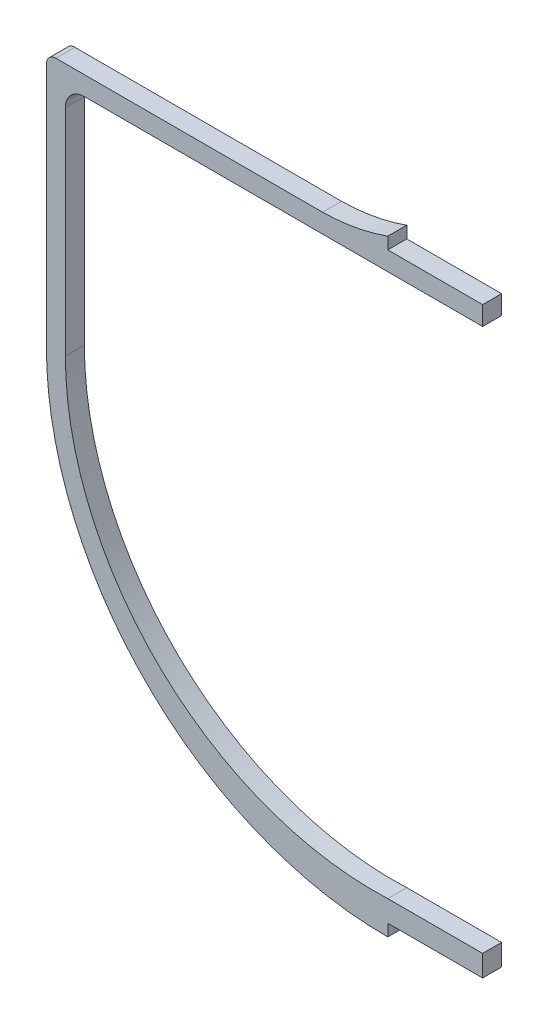
ISO-10303-21;
HEADER;
FILE_DESCRIPTION(('STEP AP214'),'2;1');
FILE_NAME('part.step','',(''),(''),'','','');
FILE_SCHEMA(('AUTOMOTIVE_DESIGN { 1 0 10303 214 1 1 1 1 }'));
ENDSEC;
DATA;
#1=APPLICATION_CONTEXT('core data for automotive mechanical design processes');
#2=APPLICATION_PROTOCOL_DEFINITION('international standard','automotive_design',2000,#1);
#3=PRODUCT_CONTEXT('',#1,'mechanical');
#4=PRODUCT('Part','Part','',(#3));
#5=PRODUCT_RELATED_PRODUCT_CATEGORY('part','',(#4));
#6=PRODUCT_DEFINITION_FORMATION('','',#4);
#7=PRODUCT_DEFINITION_CONTEXT('part definition',#1,'design');
#8=PRODUCT_DEFINITION('design','',#6,#7);
#9=PRODUCT_DEFINITION_SHAPE('','',#8);
#10=(LENGTH_UNIT() NAMED_UNIT(*) SI_UNIT(.MILLI.,.METRE.));
#11=(NAMED_UNIT(*) PLANE_ANGLE_UNIT() SI_UNIT($,.RADIAN.));
#12=(NAMED_UNIT(*) SI_UNIT($,.STERADIAN.) SOLID_ANGLE_UNIT());
#13=UNCERTAINTY_MEASURE_WITH_UNIT(LENGTH_MEASURE(1.E-05),#10,'distance_accuracy_value','');
#14=(GEOMETRIC_REPRESENTATION_CONTEXT(3) GLOBAL_UNCERTAINTY_ASSIGNED_CONTEXT((#13)) GLOBAL_UNIT_ASSIGNED_CONTEXT((#10,
#11,#12)) REPRESENTATION_CONTEXT('',''));
#15=CARTESIAN_POINT('',(0.,0.,0.));
#16=DIRECTION('',(0.,0.,1.));
#17=DIRECTION('',(1.,0.,0.));
#18=AXIS2_PLACEMENT_3D('',#15,#16,#17);
#19=CARTESIAN_POINT('',(-0.274438164377958,71.725981806473,4.));
#20=DIRECTION('',(0.,0.,-1.));
#21=DIRECTION('',(-1.,0.,0.));
#22=AXIS2_PLACEMENT_3D('',#19,#20,#21);
#23=CYLINDRICAL_SURFACE('',#22,71.7265068326108);
#24=CARTESIAN_POINT('',(-0.274438164377958,71.725981806473,0.));
#25=DIRECTION('',(0.,0.,1.));
#26=DIRECTION('',(1.,0.,0.));
#27=AXIS2_PLACEMENT_3D('',#24,#25,#26);
#28=CIRCLE('',#27,71.7265068326108);
#29=CARTESIAN_POINT('',(-72.,72.094168950364,0.));
#30=VERTEX_POINT('',#29);
#31=CARTESIAN_POINT('',(0.,0.,0.));
#32=VERTEX_POINT('',#31);
#33=EDGE_CURVE('E176',#30,#32,#28,.T.);
#34=ORIENTED_EDGE('',*,*,#33,.T.);
#35=DIRECTION('',(0.,0.,-1.));
#36=VECTOR('',#35,1.);
#37=CARTESIAN_POINT('',(0.,0.,4.));
#38=LINE('',#37,#36);
#39=CARTESIAN_POINT('',(0.,0.,4.));
#40=VERTEX_POINT('',#39);
#41=EDGE_CURVE('E155',#40,#32,#38,.T.);
#42=ORIENTED_EDGE('',*,*,#41,.F.);
#43=CARTESIAN_POINT('',(-0.274438164377958,71.725981806473,4.));
#44=DIRECTION('',(0.,0.,1.));
#45=DIRECTION('',(1.,0.,0.));
#46=AXIS2_PLACEMENT_3D('',#43,#44,#45);
#47=CIRCLE('',#46,71.7265068326108);
#48=CARTESIAN_POINT('',(-72.,72.094168950364,4.));
#49=VERTEX_POINT('',#48);
#50=EDGE_CURVE('E163',#49,#40,#47,.T.);
#51=ORIENTED_EDGE('',*,*,#50,.F.);
#52=DIRECTION('',(0.,0.,-1.));
#53=VECTOR('',#52,1.);
#54=CARTESIAN_POINT('',(-72.,72.094168950364,4.));
#55=LINE('',#54,#53);
#56=EDGE_CURVE('E217',#49,#30,#55,.T.);
#57=ORIENTED_EDGE('',*,*,#56,.T.);
#58=EDGE_LOOP('',(#34,#42,#51,#57));
#59=FACE_BOUND('',#58,.T.);
#60=ADVANCED_FACE('F38',(#59),#23,.T.);
#61=CARTESIAN_POINT('',(0.,0.,4.));
#62=DIRECTION('',(-1.,0.,0.));
#63=DIRECTION('',(0.,0.,1.));
#64=AXIS2_PLACEMENT_3D('',#61,#62,#63);
#65=PLANE('',#64);
#66=DIRECTION('',(0.,1.,0.));
#67=VECTOR('',#66,1.);
#68=CARTESIAN_POINT('',(0.,0.,0.));
#69=LINE('',#68,#67);
#70=CARTESIAN_POINT('',(0.,2.5,0.));
#71=VERTEX_POINT('',#70);
#72=EDGE_CURVE('E273',#32,#71,#69,.T.);
#73=ORIENTED_EDGE('',*,*,#72,.T.);
#74=DIRECTION('',(0.,0.,-1.));
#75=VECTOR('',#74,1.);
#76=CARTESIAN_POINT('',(0.,2.5,4.));
#77=LINE('',#76,#75);
#78=CARTESIAN_POINT('',(0.,2.5,4.));
#79=VERTEX_POINT('',#78);
#80=EDGE_CURVE('E158',#79,#71,#77,.T.);
#81=ORIENTED_EDGE('',*,*,#80,.F.);
#82=DIRECTION('',(0.,1.,0.));
#83=VECTOR('',#82,1.);
#84=CARTESIAN_POINT('',(0.,0.,4.));
#85=LINE('',#84,#83);
#86=EDGE_CURVE('E151',#40,#79,#85,.T.);
#87=ORIENTED_EDGE('',*,*,#86,.F.);
#88=ORIENTED_EDGE('',*,*,#41,.T.);
#89=EDGE_LOOP('',(#73,#81,#87,#88));
#90=FACE_BOUND('',#89,.T.);
#91=ADVANCED_FACE('F153',(#90),#65,.F.);
#92=CARTESIAN_POINT('',(0.,2.5,4.));
#93=DIRECTION('',(0.,1.,0.));
#94=DIRECTION('',(0.,0.,1.));
#95=AXIS2_PLACEMENT_3D('',#92,#93,#94);
#96=PLANE('',#95);
#97=DIRECTION('',(1.,0.,0.));
#98=VECTOR('',#97,1.);
#99=CARTESIAN_POINT('',(0.,2.5,0.));
#100=LINE('',#99,#98);
#101=CARTESIAN_POINT('',(20.,2.5,0.));
#102=VERTEX_POINT('',#101);
#103=EDGE_CURVE('E264',#71,#102,#100,.T.);
#104=ORIENTED_EDGE('',*,*,#103,.T.);
#105=DIRECTION('',(0.,0.,-1.));
#106=VECTOR('',#105,1.);
#107=CARTESIAN_POINT('',(20.,2.5,4.));
#108=LINE('',#107,#106);
#109=CARTESIAN_POINT('',(20.,2.5,4.));
#110=VERTEX_POINT('',#109);
#111=EDGE_CURVE('E185',#110,#102,#108,.T.);
#112=ORIENTED_EDGE('',*,*,#111,.F.);
#113=DIRECTION('',(1.,0.,0.));
#114=VECTOR('',#113,1.);
#115=CARTESIAN_POINT('',(0.,2.5,4.));
#116=LINE('',#115,#114);
#117=EDGE_CURVE('E162',#79,#110,#116,.T.);
#118=ORIENTED_EDGE('',*,*,#117,.F.);
#119=ORIENTED_EDGE('',*,*,#80,.T.);
#120=EDGE_LOOP('',(#104,#112,#118,#119));
#121=FACE_BOUND('',#120,.T.);
#122=ADVANCED_FACE('F317',(#121),#96,.F.);
#123=CARTESIAN_POINT('',(20.,2.5,4.));
#124=DIRECTION('',(-1.,0.,0.));
#125=DIRECTION('',(0.,0.,1.));
#126=AXIS2_PLACEMENT_3D('',#123,#124,#125);
#127=PLANE('',#126);
#128=DIRECTION('',(0.,1.,0.));
#129=VECTOR('',#128,1.);
#130=CARTESIAN_POINT('',(20.,2.5,0.));
#131=LINE('',#130,#129);
#132=CARTESIAN_POINT('',(20.,7.,0.));
#133=VERTEX_POINT('',#132);
#134=EDGE_CURVE('E259',#102,#133,#131,.T.);
#135=ORIENTED_EDGE('',*,*,#134,.T.);
#136=DIRECTION('',(0.,0.,-1.));
#137=VECTOR('',#136,1.);
#138=CARTESIAN_POINT('',(20.,7.,4.));
#139=LINE('',#138,#137);
#140=CARTESIAN_POINT('',(20.,7.,4.));
#141=VERTEX_POINT('',#140);
#142=EDGE_CURVE('E248',#141,#133,#139,.T.);
#143=ORIENTED_EDGE('',*,*,#142,.F.);
#144=DIRECTION('',(0.,1.,0.));
#145=VECTOR('',#144,1.);
#146=CARTESIAN_POINT('',(20.,2.5,4.));
#147=LINE('',#146,#145);
#148=EDGE_CURVE('E260',#110,#141,#147,.T.);
#149=ORIENTED_EDGE('',*,*,#148,.F.);
#150=ORIENTED_EDGE('',*,*,#111,.T.);
#151=EDGE_LOOP('',(#135,#143,#149,#150));
#152=FACE_BOUND('',#151,.T.);
#153=ADVANCED_FACE('F257',(#152),#127,.F.);
#154=CARTESIAN_POINT('',(20.,7.,4.));
#155=DIRECTION('',(0.,-1.,0.));
#156=DIRECTION('',(1.,0.,0.));
#157=AXIS2_PLACEMENT_3D('',#154,#155,#156);
#158=PLANE('',#157);
#159=DIRECTION('',(-1.,0.,0.));
#160=VECTOR('',#159,1.);
#161=CARTESIAN_POINT('',(20.,7.,0.));
#162=LINE('',#161,#160);
#163=CARTESIAN_POINT('',(0.,7.,0.));
#164=VERTEX_POINT('',#163);
#165=EDGE_CURVE('E266',#133,#164,#162,.T.);
#166=ORIENTED_EDGE('',*,*,#165,.T.);
#167=DIRECTION('',(0.,0.,-1.));
#168=VECTOR('',#167,1.);
#169=CARTESIAN_POINT('',(0.,7.,4.));
#170=LINE('',#169,#168);
#171=CARTESIAN_POINT('',(0.,7.,4.));
#172=VERTEX_POINT('',#171);
#173=EDGE_CURVE('E244',#172,#164,#170,.T.);
#174=ORIENTED_EDGE('',*,*,#173,.F.);
#175=DIRECTION('',(-1.,0.,0.));
#176=VECTOR('',#175,1.);
#177=CARTESIAN_POINT('',(20.,7.,4.));
#178=LINE('',#177,#176);
#179=EDGE_CURVE('E321',#141,#172,#178,.T.);
#180=ORIENTED_EDGE('',*,*,#179,.F.);
#181=ORIENTED_EDGE('',*,*,#142,.T.);
#182=EDGE_LOOP('',(#166,#174,#180,#181));
#183=FACE_BOUND('',#182,.T.);
#184=ADVANCED_FACE('F376',(#183),#158,.F.);
#185=CARTESIAN_POINT('',(-2.8437438872209,72.0941689503596,4.));
#186=DIRECTION('',(0.,0.,-1.));
#187=DIRECTION('',(-1.,0.,0.));
#188=AXIS2_PLACEMENT_3D('',#185,#186,#187);
#189=CYLINDRICAL_SURFACE('',#188,65.1562561127791);
#190=CARTESIAN_POINT('',(-2.8437438872209,72.0941689503596,0.));
#191=DIRECTION('',(0.,0.,-1.));
#192=DIRECTION('',(1.,0.,0.));
#193=AXIS2_PLACEMENT_3D('',#190,#191,#192);
#194=CIRCLE('',#193,65.1562561127791);
#195=CARTESIAN_POINT('',(-68.,72.0941689503596,0.));
#196=VERTEX_POINT('',#195);
#197=EDGE_CURVE('E271',#164,#196,#194,.T.);
#198=ORIENTED_EDGE('',*,*,#197,.T.);
#199=DIRECTION('',(0.,0.,-1.));
#200=VECTOR('',#199,1.);
#201=CARTESIAN_POINT('',(-68.,72.0941689503596,4.));
#202=LINE('',#201,#200);
#203=CARTESIAN_POINT('',(-68.,72.0941689503596,4.));
#204=VERTEX_POINT('',#203);
#205=EDGE_CURVE('E240',#204,#196,#202,.T.);
#206=ORIENTED_EDGE('',*,*,#205,.F.);
#207=CARTESIAN_POINT('',(-2.8437438872209,72.0941689503596,4.));
#208=DIRECTION('',(0.,0.,-1.));
#209=DIRECTION('',(1.,0.,0.));
#210=AXIS2_PLACEMENT_3D('',#207,#208,#209);
#211=CIRCLE('',#210,65.1562561127791);
#212=EDGE_CURVE('E326',#172,#204,#211,.T.);
#213=ORIENTED_EDGE('',*,*,#212,.F.);
#214=ORIENTED_EDGE('',*,*,#173,.T.);
#215=EDGE_LOOP('',(#198,#206,#213,#214));
#216=FACE_BOUND('',#215,.T.);
#217=ADVANCED_FACE('F374',(#216),#189,.F.);
#218=CARTESIAN_POINT('',(-68.,121.5,4.));
#219=DIRECTION('',(-1.,0.,0.));
#220=DIRECTION('',(0.,-1.,0.));
#221=AXIS2_PLACEMENT_3D('',#218,#219,#220);
#222=PLANE('',#221);
#223=DIRECTION('',(0.,1.,0.));
#224=VECTOR('',#223,1.);
#225=CARTESIAN_POINT('',(-68.,121.5,0.));
#226=LINE('',#225,#224);
#227=CARTESIAN_POINT('',(-68.,117.5,0.));
#228=VERTEX_POINT('',#227);
#229=EDGE_CURVE('E279',#196,#228,#226,.T.);
#230=ORIENTED_EDGE('',*,*,#229,.T.);
#231=DIRECTION('',(0.,0.,-1.));
#232=VECTOR('',#231,1.);
#233=CARTESIAN_POINT('',(-68.,117.5,4.));
#234=LINE('',#233,#232);
#235=CARTESIAN_POINT('',(-68.,117.5,4.));
#236=VERTEX_POINT('',#235);
#237=EDGE_CURVE('E183',#228,#236,#234,.F.);
#238=ORIENTED_EDGE('',*,*,#237,.T.);
#239=DIRECTION('',(0.,1.,0.));
#240=VECTOR('',#239,1.);
#241=CARTESIAN_POINT('',(-68.,121.5,4.));
#242=LINE('',#241,#240);
#243=EDGE_CURVE('E329',#204,#236,#242,.T.);
#244=ORIENTED_EDGE('',*,*,#243,.F.);
#245=ORIENTED_EDGE('',*,*,#205,.T.);
#246=EDGE_LOOP('',(#230,#238,#244,#245));
#247=FACE_BOUND('',#246,.T.);
#248=ADVANCED_FACE('F365',(#247),#222,.F.);
#249=CARTESIAN_POINT('',(-68.,121.5,4.));
#250=DIRECTION('',(0.,1.,0.));
#251=DIRECTION('',(-1.,0.,0.));
#252=AXIS2_PLACEMENT_3D('',#249,#250,#251);
#253=PLANE('',#252);
#254=DIRECTION('',(1.,0.,0.));
#255=VECTOR('',#254,1.);
#256=CARTESIAN_POINT('',(-68.,121.5,4.));
#257=LINE('',#256,#255);
#258=CARTESIAN_POINT('',(-64.,121.5,4.));
#259=VERTEX_POINT('',#258);
#260=CARTESIAN_POINT('',(20.,121.5,4.));
#261=VERTEX_POINT('',#260);
#262=EDGE_CURVE('E333',#259,#261,#257,.T.);
#263=ORIENTED_EDGE('',*,*,#262,.F.);
#264=DIRECTION('',(0.,0.,-1.));
#265=VECTOR('',#264,1.);
#266=CARTESIAN_POINT('',(-64.,121.5,0.));
#267=LINE('',#266,#265);
#268=CARTESIAN_POINT('',(-64.,121.5,0.));
#269=VERTEX_POINT('',#268);
#270=EDGE_CURVE('E178',#259,#269,#267,.T.);
#271=ORIENTED_EDGE('',*,*,#270,.T.);
#272=DIRECTION('',(1.,0.,0.));
#273=VECTOR('',#272,1.);
#274=CARTESIAN_POINT('',(-68.,121.5,0.));
#275=LINE('',#274,#273);
#276=CARTESIAN_POINT('',(20.,121.5,0.));
#277=VERTEX_POINT('',#276);
#278=EDGE_CURVE('E283',#269,#277,#275,.T.);
#279=ORIENTED_EDGE('',*,*,#278,.T.);
#280=DIRECTION('',(0.,0.,-1.));
#281=VECTOR('',#280,1.);
#282=CARTESIAN_POINT('',(20.,121.5,4.));
#283=LINE('',#282,#281);
#284=EDGE_CURVE('E236',#261,#277,#283,.T.);
#285=ORIENTED_EDGE('',*,*,#284,.F.);
#286=EDGE_LOOP('',(#263,#271,#279,#285));
#287=FACE_BOUND('',#286,.T.);
#288=ADVANCED_FACE('F359',(#287),#253,.F.);
#289=CARTESIAN_POINT('',(20.,125.5,4.));
#290=DIRECTION('',(-1.,0.,0.));
#291=DIRECTION('',(0.,0.,1.));
#292=AXIS2_PLACEMENT_3D('',#289,#290,#291);
#293=PLANE('',#292);
#294=DIRECTION('',(0.,1.,0.));
#295=VECTOR('',#294,1.);
#296=CARTESIAN_POINT('',(20.,125.5,0.));
#297=LINE('',#296,#295);
#298=CARTESIAN_POINT('',(20.,125.5,0.));
#299=VERTEX_POINT('',#298);
#300=EDGE_CURVE('E286',#277,#299,#297,.T.);
#301=ORIENTED_EDGE('',*,*,#300,.T.);
#302=DIRECTION('',(0.,0.,-1.));
#303=VECTOR('',#302,1.);
#304=CARTESIAN_POINT('',(20.,125.5,4.));
#305=LINE('',#304,#303);
#306=CARTESIAN_POINT('',(20.,125.5,4.));
#307=VERTEX_POINT('',#306);
#308=EDGE_CURVE('E232',#307,#299,#305,.T.);
#309=ORIENTED_EDGE('',*,*,#308,.F.);
#310=DIRECTION('',(0.,1.,0.));
#311=VECTOR('',#310,1.);
#312=CARTESIAN_POINT('',(20.,125.5,4.));
#313=LINE('',#312,#311);
#314=EDGE_CURVE('E336',#261,#307,#313,.T.);
#315=ORIENTED_EDGE('',*,*,#314,.F.);
#316=ORIENTED_EDGE('',*,*,#284,.T.);
#317=EDGE_LOOP('',(#301,#309,#315,#316));
#318=FACE_BOUND('',#317,.T.);
#319=ADVANCED_FACE('F355',(#318),#293,.F.);
#320=CARTESIAN_POINT('',(0.,125.5,4.));
#321=DIRECTION('',(0.,-1.,0.));
#322=DIRECTION('',(0.,0.,-1.));
#323=AXIS2_PLACEMENT_3D('',#320,#321,#322);
#324=PLANE('',#323);
#325=DIRECTION('',(-1.,0.,0.));
#326=VECTOR('',#325,1.);
#327=CARTESIAN_POINT('',(0.,125.5,0.));
#328=LINE('',#327,#326);
#329=CARTESIAN_POINT('',(0.,125.5,0.));
#330=VERTEX_POINT('',#329);
#331=EDGE_CURVE('E289',#299,#330,#328,.T.);
#332=ORIENTED_EDGE('',*,*,#331,.T.);
#333=DIRECTION('',(0.,0.,-1.));
#334=VECTOR('',#333,1.);
#335=CARTESIAN_POINT('',(0.,125.5,4.));
#336=LINE('',#335,#334);
#337=CARTESIAN_POINT('',(0.,125.5,4.));
#338=VERTEX_POINT('',#337);
#339=EDGE_CURVE('E228',#338,#330,#336,.T.);
#340=ORIENTED_EDGE('',*,*,#339,.F.);
#341=DIRECTION('',(-1.,0.,0.));
#342=VECTOR('',#341,1.);
#343=CARTESIAN_POINT('',(0.,125.5,4.));
#344=LINE('',#343,#342);
#345=EDGE_CURVE('E339',#307,#338,#344,.T.);
#346=ORIENTED_EDGE('',*,*,#345,.F.);
#347=ORIENTED_EDGE('',*,*,#308,.T.);
#348=EDGE_LOOP('',(#332,#340,#346,#347));
#349=FACE_BOUND('',#348,.T.);
#350=ADVANCED_FACE('F351',(#349),#324,.F.);
#351=CARTESIAN_POINT('',(0.,128.,4.));
#352=DIRECTION('',(-1.,0.,0.));
#353=DIRECTION('',(0.,0.,1.));
#354=AXIS2_PLACEMENT_3D('',#351,#352,#353);
#355=PLANE('',#354);
#356=DIRECTION('',(0.,1.,0.));
#357=VECTOR('',#356,1.);
#358=CARTESIAN_POINT('',(0.,128.,0.));
#359=LINE('',#358,#357);
#360=CARTESIAN_POINT('',(0.,128.,0.));
#361=VERTEX_POINT('',#360);
#362=EDGE_CURVE('E292',#330,#361,#359,.T.);
#363=ORIENTED_EDGE('',*,*,#362,.T.);
#364=DIRECTION('',(0.,0.,-1.));
#365=VECTOR('',#364,1.);
#366=CARTESIAN_POINT('',(0.,128.,4.));
#367=LINE('',#366,#365);
#368=CARTESIAN_POINT('',(0.,128.,4.));
#369=VERTEX_POINT('',#368);
#370=EDGE_CURVE('E224',#369,#361,#367,.T.);
#371=ORIENTED_EDGE('',*,*,#370,.F.);
#372=DIRECTION('',(0.,1.,0.));
#373=VECTOR('',#372,1.);
#374=CARTESIAN_POINT('',(0.,128.,4.));
#375=LINE('',#374,#373);
#376=EDGE_CURVE('E311',#338,#369,#375,.T.);
#377=ORIENTED_EDGE('',*,*,#376,.F.);
#378=ORIENTED_EDGE('',*,*,#339,.T.);
#379=EDGE_LOOP('',(#363,#371,#377,#378));
#380=FACE_BOUND('',#379,.T.);
#381=ADVANCED_FACE('F346',(#380),#355,.F.);
#382=CARTESIAN_POINT('',(-14.3761533989279,168.006920393567,4.));
#383=DIRECTION('',(0.,0.,-1.));
#384=DIRECTION('',(-1.,0.,0.));
#385=AXIS2_PLACEMENT_3D('',#382,#383,#384);
#386=CYLINDRICAL_SURFACE('',#385,42.511498043785);
#387=CARTESIAN_POINT('',(-14.3761533989279,168.006920393567,0.));
#388=DIRECTION('',(0.,0.,-1.));
#389=DIRECTION('',(-1.,0.,0.));
#390=AXIS2_PLACEMENT_3D('',#387,#388,#389);
#391=CIRCLE('',#390,42.511498043785);
#392=CARTESIAN_POINT('',(-13.7523067978557,125.5,0.));
#393=VERTEX_POINT('',#392);
#394=EDGE_CURVE('E213',#361,#393,#391,.T.);
#395=ORIENTED_EDGE('',*,*,#394,.T.);
#396=DIRECTION('',(0.,0.,-1.));
#397=VECTOR('',#396,1.);
#398=CARTESIAN_POINT('',(-13.7523067978557,125.5,4.));
#399=LINE('',#398,#397);
#400=CARTESIAN_POINT('',(-13.7523067978557,125.5,4.));
#401=VERTEX_POINT('',#400);
#402=EDGE_CURVE('E220',#401,#393,#399,.T.);
#403=ORIENTED_EDGE('',*,*,#402,.F.);
#404=CARTESIAN_POINT('',(-14.3761533989279,168.006920393567,4.));
#405=DIRECTION('',(0.,0.,-1.));
#406=DIRECTION('',(-1.,0.,0.));
#407=AXIS2_PLACEMENT_3D('',#404,#405,#406);
#408=CIRCLE('',#407,42.511498043785);
#409=EDGE_CURVE('E306',#369,#401,#408,.T.);
#410=ORIENTED_EDGE('',*,*,#409,.F.);
#411=ORIENTED_EDGE('',*,*,#370,.T.);
#412=EDGE_LOOP('',(#395,#403,#410,#411));
#413=FACE_BOUND('',#412,.T.);
#414=ADVANCED_FACE('F299',(#413),#386,.F.);
#415=CARTESIAN_POINT('',(-68.,125.5,4.));
#416=DIRECTION('',(0.,-1.,0.));
#417=DIRECTION('',(0.,0.,-1.));
#418=AXIS2_PLACEMENT_3D('',#415,#416,#417);
#419=PLANE('',#418);
#420=DIRECTION('',(-1.,0.,0.));
#421=VECTOR('',#420,1.);
#422=CARTESIAN_POINT('',(-68.,125.5,0.));
#423=LINE('',#422,#421);
#424=CARTESIAN_POINT('',(-70.,125.5,0.));
#425=VERTEX_POINT('',#424);
#426=EDGE_CURVE('E210',#393,#425,#423,.T.);
#427=ORIENTED_EDGE('',*,*,#426,.T.);
#428=DIRECTION('',(0.,0.,-1.));
#429=VECTOR('',#428,1.);
#430=CARTESIAN_POINT('',(-70.,125.5,4.));
#431=LINE('',#430,#429);
#432=CARTESIAN_POINT('',(-70.,125.5,4.));
#433=VERTEX_POINT('',#432);
#434=EDGE_CURVE('E47',#425,#433,#431,.F.);
#435=ORIENTED_EDGE('',*,*,#434,.T.);
#436=DIRECTION('',(-1.,0.,0.));
#437=VECTOR('',#436,1.);
#438=CARTESIAN_POINT('',(-68.,125.5,4.));
#439=LINE('',#438,#437);
#440=EDGE_CURVE('E304',#401,#433,#439,.T.);
#441=ORIENTED_EDGE('',*,*,#440,.F.);
#442=ORIENTED_EDGE('',*,*,#402,.T.);
#443=EDGE_LOOP('',(#427,#435,#441,#442));
#444=FACE_BOUND('',#443,.T.);
#445=ADVANCED_FACE('F303',(#444),#419,.F.);
#446=CARTESIAN_POINT('',(-72.,125.5,4.));
#447=DIRECTION('',(1.,0.,0.));
#448=DIRECTION('',(0.,0.,-1.));
#449=AXIS2_PLACEMENT_3D('',#446,#447,#448);
#450=PLANE('',#449);
#451=DIRECTION('',(0.,-1.,0.));
#452=VECTOR('',#451,1.);
#453=CARTESIAN_POINT('',(-72.,125.5,4.));
#454=LINE('',#453,#452);
#455=CARTESIAN_POINT('',(-72.,123.5,4.));
#456=VERTEX_POINT('',#455);
#457=EDGE_CURVE('E168',#456,#49,#454,.T.);
#458=ORIENTED_EDGE('',*,*,#457,.F.);
#459=DIRECTION('',(0.,0.,-1.));
#460=VECTOR('',#459,1.);
#461=CARTESIAN_POINT('',(-72.,123.5,4.));
#462=LINE('',#461,#460);
#463=CARTESIAN_POINT('',(-72.,123.5,0.));
#464=VERTEX_POINT('',#463);
#465=EDGE_CURVE('E197',#456,#464,#462,.T.);
#466=ORIENTED_EDGE('',*,*,#465,.T.);
#467=DIRECTION('',(0.,-1.,0.));
#468=VECTOR('',#467,1.);
#469=CARTESIAN_POINT('',(-72.,125.5,0.));
#470=LINE('',#469,#468);
#471=EDGE_CURVE('E173',#464,#30,#470,.T.);
#472=ORIENTED_EDGE('',*,*,#471,.T.);
#473=ORIENTED_EDGE('',*,*,#56,.F.);
#474=EDGE_LOOP('',(#458,#466,#472,#473));
#475=FACE_BOUND('',#474,.T.);
#476=ADVANCED_FACE('F205',(#475),#450,.F.);
#477=CARTESIAN_POINT('',(-0.274438164377958,71.725981806473,4.));
#478=DIRECTION('',(0.,0.,1.));
#479=DIRECTION('',(1.,0.,0.));
#480=AXIS2_PLACEMENT_3D('',#477,#478,#479);
#481=PLANE('',#480);
#482=ORIENTED_EDGE('',*,*,#440,.T.);
#483=CARTESIAN_POINT('',(-70.,123.5,4.));
#484=DIRECTION('',(0.,0.,1.));
#485=DIRECTION('',(1.,0.,0.));
#486=AXIS2_PLACEMENT_3D('',#483,#484,#485);
#487=CIRCLE('',#486,2.);
#488=EDGE_CURVE('E11',#433,#456,#487,.T.);
#489=ORIENTED_EDGE('',*,*,#488,.T.);
#490=ORIENTED_EDGE('',*,*,#457,.T.);
#491=ORIENTED_EDGE('',*,*,#50,.T.);
#492=ORIENTED_EDGE('',*,*,#86,.T.);
#493=ORIENTED_EDGE('',*,*,#117,.T.);
#494=ORIENTED_EDGE('',*,*,#148,.T.);
#495=ORIENTED_EDGE('',*,*,#179,.T.);
#496=ORIENTED_EDGE('',*,*,#212,.T.);
#497=ORIENTED_EDGE('',*,*,#243,.T.);
#498=CARTESIAN_POINT('',(-64.,117.5,4.));
#499=DIRECTION('',(0.,0.,1.));
#500=DIRECTION('',(1.,0.,0.));
#501=AXIS2_PLACEMENT_3D('',#498,#499,#500);
#502=CIRCLE('',#501,4.);
#503=EDGE_CURVE('E194',#236,#259,#502,.F.);
#504=ORIENTED_EDGE('',*,*,#503,.T.);
#505=ORIENTED_EDGE('',*,*,#262,.T.);
#506=ORIENTED_EDGE('',*,*,#314,.T.);
#507=ORIENTED_EDGE('',*,*,#345,.T.);
#508=ORIENTED_EDGE('',*,*,#376,.T.);
#509=ORIENTED_EDGE('',*,*,#409,.T.);
#510=EDGE_LOOP('',(#482,#489,#490,#491,#492,#493,#494,#495,#496,#497,#504,#505,#506,#507,#508,#509));
#511=FACE_BOUND('',#510,.T.);
#512=ADVANCED_FACE('F166',(#511),#481,.T.);
#513=CARTESIAN_POINT('',(-0.274438164377958,71.725981806473,0.));
#514=DIRECTION('',(0.,0.,1.));
#515=DIRECTION('',(1.,0.,0.));
#516=AXIS2_PLACEMENT_3D('',#513,#514,#515);
#517=PLANE('',#516);
#518=ORIENTED_EDGE('',*,*,#471,.F.);
#519=CARTESIAN_POINT('',(-70.,123.5,0.));
#520=DIRECTION('',(0.,0.,1.));
#521=DIRECTION('',(1.,0.,0.));
#522=AXIS2_PLACEMENT_3D('',#519,#520,#521);
#523=CIRCLE('',#522,2.);
#524=EDGE_CURVE('E61',#464,#425,#523,.F.);
#525=ORIENTED_EDGE('',*,*,#524,.T.);
#526=ORIENTED_EDGE('',*,*,#426,.F.);
#527=ORIENTED_EDGE('',*,*,#394,.F.);
#528=ORIENTED_EDGE('',*,*,#362,.F.);
#529=ORIENTED_EDGE('',*,*,#331,.F.);
#530=ORIENTED_EDGE('',*,*,#300,.F.);
#531=ORIENTED_EDGE('',*,*,#278,.F.);
#532=CARTESIAN_POINT('',(-64.,117.5,0.));
#533=DIRECTION('',(0.,0.,1.));
#534=DIRECTION('',(1.,0.,0.));
#535=AXIS2_PLACEMENT_3D('',#532,#533,#534);
#536=CIRCLE('',#535,4.);
#537=EDGE_CURVE('E191',#269,#228,#536,.T.);
#538=ORIENTED_EDGE('',*,*,#537,.T.);
#539=ORIENTED_EDGE('',*,*,#229,.F.);
#540=ORIENTED_EDGE('',*,*,#197,.F.);
#541=ORIENTED_EDGE('',*,*,#165,.F.);
#542=ORIENTED_EDGE('',*,*,#134,.F.);
#543=ORIENTED_EDGE('',*,*,#103,.F.);
#544=ORIENTED_EDGE('',*,*,#72,.F.);
#545=ORIENTED_EDGE('',*,*,#33,.F.);
#546=EDGE_LOOP('',(#518,#525,#526,#527,#528,#529,#530,#531,#538,#539,#540,#541,#542,#543,#544,#545));
#547=FACE_BOUND('',#546,.T.);
#548=ADVANCED_FACE('F208',(#547),#517,.F.);
#549=CARTESIAN_POINT('',(-64.,117.5,4.));
#550=DIRECTION('',(0.,0.,1.));
#551=DIRECTION('',(1.,0.,0.));
#552=AXIS2_PLACEMENT_3D('',#549,#550,#551);
#553=CYLINDRICAL_SURFACE('',#552,4.);
#554=ORIENTED_EDGE('',*,*,#503,.F.);
#555=ORIENTED_EDGE('',*,*,#237,.F.);
#556=ORIENTED_EDGE('',*,*,#537,.F.);
#557=ORIENTED_EDGE('',*,*,#270,.F.);
#558=EDGE_LOOP('',(#554,#555,#556,#557));
#559=FACE_BOUND('',#558,.T.);
#560=ADVANCED_FACE('F369',(#559),#553,.F.);
#561=CARTESIAN_POINT('',(-70.,123.5,4.));
#562=DIRECTION('',(0.,0.,-1.));
#563=DIRECTION('',(-1.,0.,0.));
#564=AXIS2_PLACEMENT_3D('',#561,#562,#563);
#565=CYLINDRICAL_SURFACE('',#564,2.);
#566=ORIENTED_EDGE('',*,*,#488,.F.);
#567=ORIENTED_EDGE('',*,*,#434,.F.);
#568=ORIENTED_EDGE('',*,*,#524,.F.);
#569=ORIENTED_EDGE('',*,*,#465,.F.);
#570=EDGE_LOOP('',(#566,#567,#568,#569));
#571=FACE_BOUND('',#570,.T.);
#572=ADVANCED_FACE('F40',(#571),#565,.T.);
#573=CLOSED_SHELL('',(#60,#91,#122,#153,#184,#217,#248,#288,#319,#350,#381,#414,#445,#476,#512,
#548,#560,#572));
#574=MANIFOLD_SOLID_BREP('B2',#573);
#575=ADVANCED_BREP_SHAPE_REPRESENTATION('',(#18,#574),#14);
#576=SHAPE_DEFINITION_REPRESENTATION(#9,#575);
ENDSEC;
END-ISO-10303-21;
